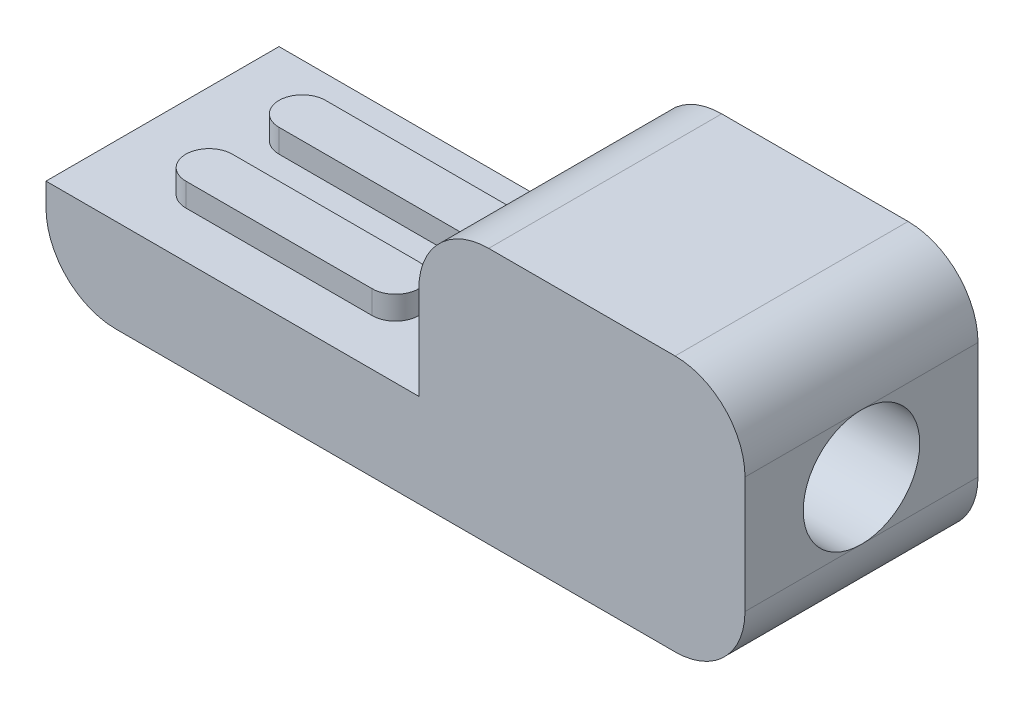
ISO-10303-21;
HEADER;
FILE_DESCRIPTION(('STEP AP214'),'2;1');
FILE_NAME('part.step','',(''),(''),'','','');
FILE_SCHEMA(('AUTOMOTIVE_DESIGN { 1 0 10303 214 1 1 1 1 }'));
ENDSEC;
DATA;
#1=APPLICATION_CONTEXT('core data for automotive mechanical design processes');
#2=APPLICATION_PROTOCOL_DEFINITION('international standard','automotive_design',2000,#1);
#3=PRODUCT_CONTEXT('',#1,'mechanical');
#4=PRODUCT('Part','Part','',(#3));
#5=PRODUCT_RELATED_PRODUCT_CATEGORY('part','',(#4));
#6=PRODUCT_DEFINITION_FORMATION('','',#4);
#7=PRODUCT_DEFINITION_CONTEXT('part definition',#1,'design');
#8=PRODUCT_DEFINITION('design','',#6,#7);
#9=PRODUCT_DEFINITION_SHAPE('','',#8);
#10=(LENGTH_UNIT() NAMED_UNIT(*) SI_UNIT(.MILLI.,.METRE.));
#11=(NAMED_UNIT(*) PLANE_ANGLE_UNIT() SI_UNIT($,.RADIAN.));
#12=(NAMED_UNIT(*) SI_UNIT($,.STERADIAN.) SOLID_ANGLE_UNIT());
#13=UNCERTAINTY_MEASURE_WITH_UNIT(LENGTH_MEASURE(1.E-05),#10,'distance_accuracy_value','');
#14=(GEOMETRIC_REPRESENTATION_CONTEXT(3) GLOBAL_UNCERTAINTY_ASSIGNED_CONTEXT((#13)) GLOBAL_UNIT_ASSIGNED_CONTEXT((#10,
#11,#12)) REPRESENTATION_CONTEXT('',''));
#15=CARTESIAN_POINT('',(0.,0.,0.));
#16=DIRECTION('',(0.,0.,1.));
#17=DIRECTION('',(1.,0.,0.));
#18=AXIS2_PLACEMENT_3D('',#15,#16,#17);
#19=CARTESIAN_POINT('',(-15.,2.,2.5));
#20=DIRECTION('',(0.,-1.,0.));
#21=DIRECTION('',(1.,0.,0.));
#22=AXIS2_PLACEMENT_3D('',#19,#20,#21);
#23=PLANE('',#22);
#24=CARTESIAN_POINT('',(-13.,2.,-1.));
#25=DIRECTION('',(0.,1.,0.));
#26=DIRECTION('',(0.,0.,1.));
#27=AXIS2_PLACEMENT_3D('',#24,#25,#26);
#28=CIRCLE('',#27,0.5);
#29=CARTESIAN_POINT('',(-13.,2.,-1.5));
#30=VERTEX_POINT('',#29);
#31=CARTESIAN_POINT('',(-13.,2.,-0.5));
#32=VERTEX_POINT('',#31);
#33=EDGE_CURVE('E192',#30,#32,#28,.T.);
#34=ORIENTED_EDGE('',*,*,#33,.F.);
#35=DIRECTION('',(-1.,0.,0.));
#36=VECTOR('',#35,1.);
#37=CARTESIAN_POINT('',(-13.,2.,-1.5));
#38=LINE('',#37,#36);
#39=CARTESIAN_POINT('',(-9.,2.,-1.5));
#40=VERTEX_POINT('',#39);
#41=EDGE_CURVE('E205',#40,#30,#38,.T.);
#42=ORIENTED_EDGE('',*,*,#41,.F.);
#43=CARTESIAN_POINT('',(-9.,2.,-1.));
#44=DIRECTION('',(0.,1.,0.));
#45=DIRECTION('',(0.,0.,1.));
#46=AXIS2_PLACEMENT_3D('',#43,#44,#45);
#47=CIRCLE('',#46,0.5);
#48=CARTESIAN_POINT('',(-9.,2.,-0.5));
#49=VERTEX_POINT('',#48);
#50=EDGE_CURVE('E214',#49,#40,#47,.T.);
#51=ORIENTED_EDGE('',*,*,#50,.F.);
#52=DIRECTION('',(1.,0.,0.));
#53=VECTOR('',#52,1.);
#54=CARTESIAN_POINT('',(-13.,2.,-0.5));
#55=LINE('',#54,#53);
#56=EDGE_CURVE('E195',#32,#49,#55,.T.);
#57=ORIENTED_EDGE('',*,*,#56,.F.);
#58=EDGE_LOOP('',(#34,#42,#51,#57));
#59=FACE_BOUND('',#58,.T.);
#60=DIRECTION('',(-1.,0.,0.));
#61=VECTOR('',#60,1.);
#62=CARTESIAN_POINT('',(-15.,2.,-2.5));
#63=LINE('',#62,#61);
#64=CARTESIAN_POINT('',(-7.,2.,-2.5));
#65=VERTEX_POINT('',#64);
#66=CARTESIAN_POINT('',(-15.,2.,-2.5));
#67=VERTEX_POINT('',#66);
#68=EDGE_CURVE('E262',#65,#67,#63,.T.);
#69=ORIENTED_EDGE('',*,*,#68,.T.);
#70=DIRECTION('',(0.,0.,-1.));
#71=VECTOR('',#70,1.);
#72=CARTESIAN_POINT('',(-15.,2.,2.5));
#73=LINE('',#72,#71);
#74=CARTESIAN_POINT('',(-15.,2.,2.5));
#75=VERTEX_POINT('',#74);
#76=EDGE_CURVE('E254',#75,#67,#73,.T.);
#77=ORIENTED_EDGE('',*,*,#76,.F.);
#78=DIRECTION('',(-1.,0.,0.));
#79=VECTOR('',#78,1.);
#80=CARTESIAN_POINT('',(-15.,2.,2.5));
#81=LINE('',#80,#79);
#82=CARTESIAN_POINT('',(-7.,2.,2.5));
#83=VERTEX_POINT('',#82);
#84=EDGE_CURVE('E246',#83,#75,#81,.T.);
#85=ORIENTED_EDGE('',*,*,#84,.F.);
#86=DIRECTION('',(0.,0.,-1.));
#87=VECTOR('',#86,1.);
#88=CARTESIAN_POINT('',(-7.,2.,2.5));
#89=LINE('',#88,#87);
#90=EDGE_CURVE('E271',#83,#65,#89,.T.);
#91=ORIENTED_EDGE('',*,*,#90,.T.);
#92=EDGE_LOOP('',(#69,#77,#85,#91));
#93=FACE_BOUND('',#92,.T.);
#94=CARTESIAN_POINT('',(-13.,2.,1.));
#95=DIRECTION('',(0.,1.,0.));
#96=DIRECTION('',(0.,0.,-1.));
#97=AXIS2_PLACEMENT_3D('',#94,#95,#96);
#98=CIRCLE('',#97,0.5);
#99=CARTESIAN_POINT('',(-13.,2.,0.5));
#100=VERTEX_POINT('',#99);
#101=CARTESIAN_POINT('',(-13.,2.,1.5));
#102=VERTEX_POINT('',#101);
#103=EDGE_CURVE('E191',#100,#102,#98,.T.);
#104=ORIENTED_EDGE('',*,*,#103,.F.);
#105=DIRECTION('',(-1.,0.,0.));
#106=VECTOR('',#105,1.);
#107=CARTESIAN_POINT('',(-13.,2.,0.5));
#108=LINE('',#107,#106);
#109=CARTESIAN_POINT('',(-9.,2.,0.5));
#110=VERTEX_POINT('',#109);
#111=EDGE_CURVE('E188',#110,#100,#108,.T.);
#112=ORIENTED_EDGE('',*,*,#111,.F.);
#113=CARTESIAN_POINT('',(-9.,2.,1.));
#114=DIRECTION('',(0.,1.,0.));
#115=DIRECTION('',(0.,0.,-1.));
#116=AXIS2_PLACEMENT_3D('',#113,#114,#115);
#117=CIRCLE('',#116,0.5);
#118=CARTESIAN_POINT('',(-9.,2.,1.5));
#119=VERTEX_POINT('',#118);
#120=EDGE_CURVE('E57',#119,#110,#117,.T.);
#121=ORIENTED_EDGE('',*,*,#120,.F.);
#122=DIRECTION('',(1.,0.,0.));
#123=VECTOR('',#122,1.);
#124=CARTESIAN_POINT('',(-13.,2.,1.5));
#125=LINE('',#124,#123);
#126=EDGE_CURVE('E52',#102,#119,#125,.T.);
#127=ORIENTED_EDGE('',*,*,#126,.F.);
#128=EDGE_LOOP('',(#104,#112,#121,#127));
#129=FACE_BOUND('',#128,.T.);
#130=ADVANCED_FACE('F37',(#59,#93,#129),#23,.F.);
#131=CARTESIAN_POINT('',(0.,5.5,2.5));
#132=DIRECTION('',(-1.,0.,0.));
#133=DIRECTION('',(0.,-1.,0.));
#134=AXIS2_PLACEMENT_3D('',#131,#132,#133);
#135=PLANE('',#134);
#136=DIRECTION('',(0.,0.,-1.));
#137=VECTOR('',#136,1.);
#138=CARTESIAN_POINT('',(0.,1.5,2.5));
#139=LINE('',#138,#137);
#140=CARTESIAN_POINT('',(0.,1.5,2.5));
#141=VERTEX_POINT('',#140);
#142=CARTESIAN_POINT('',(0.,1.5,0.));
#143=VERTEX_POINT('',#142);
#144=EDGE_CURVE('E11',#141,#143,#139,.T.);
#145=ORIENTED_EDGE('',*,*,#144,.T.);
#146=CARTESIAN_POINT('',(0.,2.75,0.));
#147=DIRECTION('',(1.,0.,0.));
#148=DIRECTION('',(0.,0.,-1.));
#149=AXIS2_PLACEMENT_3D('',#146,#147,#148);
#150=CIRCLE('',#149,1.25);
#151=CARTESIAN_POINT('',(0.,4.,0.));
#152=VERTEX_POINT('',#151);
#153=EDGE_CURVE('E231',#152,#143,#150,.T.);
#154=ORIENTED_EDGE('',*,*,#153,.F.);
#155=DIRECTION('',(0.,0.,-1.));
#156=VECTOR('',#155,1.);
#157=CARTESIAN_POINT('',(0.,4.,2.5));
#158=LINE('',#157,#156);
#159=CARTESIAN_POINT('',(0.,4.,2.5));
#160=VERTEX_POINT('',#159);
#161=EDGE_CURVE('E304',#152,#160,#158,.F.);
#162=ORIENTED_EDGE('',*,*,#161,.T.);
#163=DIRECTION('',(0.,1.,0.));
#164=VECTOR('',#163,1.);
#165=CARTESIAN_POINT('',(0.,5.5,2.5));
#166=LINE('',#165,#164);
#167=EDGE_CURVE('E237',#141,#160,#166,.T.);
#168=ORIENTED_EDGE('',*,*,#167,.F.);
#169=EDGE_LOOP('',(#145,#154,#162,#168));
#170=FACE_BOUND('',#169,.T.);
#171=ADVANCED_FACE('F314',(#170),#135,.F.);
#172=CARTESIAN_POINT('',(0.,4.,-2.5));
#173=VERTEX_POINT('',#172);
#174=EDGE_CURVE('E305',#173,#152,#158,.F.);
#175=ORIENTED_EDGE('',*,*,#174,.T.);
#176=EDGE_CURVE('E230',#143,#152,#150,.T.);
#177=ORIENTED_EDGE('',*,*,#176,.F.);
#178=CARTESIAN_POINT('',(0.,1.5,-2.5));
#179=VERTEX_POINT('',#178);
#180=EDGE_CURVE('E45',#143,#179,#139,.T.);
#181=ORIENTED_EDGE('',*,*,#180,.T.);
#182=DIRECTION('',(0.,1.,0.));
#183=VECTOR('',#182,1.);
#184=CARTESIAN_POINT('',(0.,5.5,-2.5));
#185=LINE('',#184,#183);
#186=EDGE_CURVE('E236',#179,#173,#185,.T.);
#187=ORIENTED_EDGE('',*,*,#186,.T.);
#188=EDGE_LOOP('',(#175,#177,#181,#187));
#189=FACE_BOUND('',#188,.T.);
#190=ADVANCED_FACE('F361',(#189),#135,.F.);
#191=CARTESIAN_POINT('',(-7.,5.5,2.5));
#192=DIRECTION('',(0.,-1.,0.));
#193=DIRECTION('',(0.,0.,-1.));
#194=AXIS2_PLACEMENT_3D('',#191,#192,#193);
#195=PLANE('',#194);
#196=DIRECTION('',(-1.,0.,0.));
#197=VECTOR('',#196,1.);
#198=CARTESIAN_POINT('',(-7.,5.5,-2.5));
#199=LINE('',#198,#197);
#200=CARTESIAN_POINT('',(-1.5,5.5,-2.5));
#201=VERTEX_POINT('',#200);
#202=CARTESIAN_POINT('',(-5.5,5.5,-2.5));
#203=VERTEX_POINT('',#202);
#204=EDGE_CURVE('E257',#201,#203,#199,.T.);
#205=ORIENTED_EDGE('',*,*,#204,.T.);
#206=DIRECTION('',(0.,0.,-1.));
#207=VECTOR('',#206,1.);
#208=CARTESIAN_POINT('',(-5.5,5.5,2.5));
#209=LINE('',#208,#207);
#210=CARTESIAN_POINT('',(-5.5,5.5,2.5));
#211=VERTEX_POINT('',#210);
#212=EDGE_CURVE('E303',#203,#211,#209,.F.);
#213=ORIENTED_EDGE('',*,*,#212,.T.);
#214=DIRECTION('',(-1.,0.,0.));
#215=VECTOR('',#214,1.);
#216=CARTESIAN_POINT('',(-7.,5.5,2.5));
#217=LINE('',#216,#215);
#218=CARTESIAN_POINT('',(-1.5,5.5,2.5));
#219=VERTEX_POINT('',#218);
#220=EDGE_CURVE('E240',#219,#211,#217,.T.);
#221=ORIENTED_EDGE('',*,*,#220,.F.);
#222=DIRECTION('',(0.,0.,-1.));
#223=VECTOR('',#222,1.);
#224=CARTESIAN_POINT('',(-1.5,5.5,2.5));
#225=LINE('',#224,#223);
#226=EDGE_CURVE('E300',#219,#201,#225,.T.);
#227=ORIENTED_EDGE('',*,*,#226,.T.);
#228=EDGE_LOOP('',(#205,#213,#221,#227));
#229=FACE_BOUND('',#228,.T.);
#230=ADVANCED_FACE('F325',(#229),#195,.F.);
#231=CARTESIAN_POINT('',(-7.,2.,2.5));
#232=DIRECTION('',(1.,0.,0.));
#233=DIRECTION('',(0.,0.,-1.));
#234=AXIS2_PLACEMENT_3D('',#231,#232,#233);
#235=PLANE('',#234);
#236=DIRECTION('',(0.,-1.,0.));
#237=VECTOR('',#236,1.);
#238=CARTESIAN_POINT('',(-7.,2.,2.5));
#239=LINE('',#238,#237);
#240=CARTESIAN_POINT('',(-7.,4.,2.5));
#241=VERTEX_POINT('',#240);
#242=EDGE_CURVE('E244',#241,#83,#239,.T.);
#243=ORIENTED_EDGE('',*,*,#242,.F.);
#244=DIRECTION('',(0.,0.,-1.));
#245=VECTOR('',#244,1.);
#246=CARTESIAN_POINT('',(-7.,4.,2.5));
#247=LINE('',#246,#245);
#248=CARTESIAN_POINT('',(-7.,4.,-2.5));
#249=VERTEX_POINT('',#248);
#250=EDGE_CURVE('E297',#241,#249,#247,.T.);
#251=ORIENTED_EDGE('',*,*,#250,.T.);
#252=DIRECTION('',(0.,-1.,0.));
#253=VECTOR('',#252,1.);
#254=CARTESIAN_POINT('',(-7.,2.,-2.5));
#255=LINE('',#254,#253);
#256=EDGE_CURVE('E260',#249,#65,#255,.T.);
#257=ORIENTED_EDGE('',*,*,#256,.T.);
#258=ORIENTED_EDGE('',*,*,#90,.F.);
#259=EDGE_LOOP('',(#243,#251,#257,#258));
#260=FACE_BOUND('',#259,.T.);
#261=ADVANCED_FACE('F339',(#260),#235,.F.);
#262=CARTESIAN_POINT('',(-15.,0.,2.5));
#263=DIRECTION('',(1.,0.,0.));
#264=DIRECTION('',(0.,0.,-1.));
#265=AXIS2_PLACEMENT_3D('',#262,#263,#264);
#266=PLANE('',#265);
#267=DIRECTION('',(0.,-1.,0.));
#268=VECTOR('',#267,1.);
#269=CARTESIAN_POINT('',(-15.,0.,-2.5));
#270=LINE('',#269,#268);
#271=CARTESIAN_POINT('',(-15.,1.5,-2.5));
#272=VERTEX_POINT('',#271);
#273=EDGE_CURVE('E264',#67,#272,#270,.T.);
#274=ORIENTED_EDGE('',*,*,#273,.T.);
#275=DIRECTION('',(0.,0.,-1.));
#276=VECTOR('',#275,1.);
#277=CARTESIAN_POINT('',(-15.,1.5,2.5));
#278=LINE('',#277,#276);
#279=CARTESIAN_POINT('',(-15.,1.5,2.5));
#280=VERTEX_POINT('',#279);
#281=EDGE_CURVE('E287',#272,#280,#278,.F.);
#282=ORIENTED_EDGE('',*,*,#281,.T.);
#283=DIRECTION('',(0.,-1.,0.));
#284=VECTOR('',#283,1.);
#285=CARTESIAN_POINT('',(-15.,0.,2.5));
#286=LINE('',#285,#284);
#287=EDGE_CURVE('E248',#75,#280,#286,.T.);
#288=ORIENTED_EDGE('',*,*,#287,.F.);
#289=ORIENTED_EDGE('',*,*,#76,.T.);
#290=EDGE_LOOP('',(#274,#282,#288,#289));
#291=FACE_BOUND('',#290,.T.);
#292=ADVANCED_FACE('F348',(#291),#266,.F.);
#293=CARTESIAN_POINT('',(0.,0.,2.5));
#294=DIRECTION('',(0.,1.,0.));
#295=DIRECTION('',(-1.,0.,0.));
#296=AXIS2_PLACEMENT_3D('',#293,#294,#295);
#297=PLANE('',#296);
#298=DIRECTION('',(1.,0.,0.));
#299=VECTOR('',#298,1.);
#300=CARTESIAN_POINT('',(0.,0.,2.5));
#301=LINE('',#300,#299);
#302=CARTESIAN_POINT('',(-13.5,0.,2.5));
#303=VERTEX_POINT('',#302);
#304=CARTESIAN_POINT('',(-1.5,0.,2.5));
#305=VERTEX_POINT('',#304);
#306=EDGE_CURVE('E251',#303,#305,#301,.T.);
#307=ORIENTED_EDGE('',*,*,#306,.F.);
#308=DIRECTION('',(0.,0.,-1.));
#309=VECTOR('',#308,1.);
#310=CARTESIAN_POINT('',(-13.5,0.,2.5));
#311=LINE('',#310,#309);
#312=CARTESIAN_POINT('',(-13.5,0.,-2.5));
#313=VERTEX_POINT('',#312);
#314=EDGE_CURVE('E276',#303,#313,#311,.T.);
#315=ORIENTED_EDGE('',*,*,#314,.T.);
#316=DIRECTION('',(1.,0.,0.));
#317=VECTOR('',#316,1.);
#318=CARTESIAN_POINT('',(0.,0.,-2.5));
#319=LINE('',#318,#317);
#320=CARTESIAN_POINT('',(-1.5,0.,-2.5));
#321=VERTEX_POINT('',#320);
#322=EDGE_CURVE('E241',#313,#321,#319,.T.);
#323=ORIENTED_EDGE('',*,*,#322,.T.);
#324=DIRECTION('',(0.,0.,-1.));
#325=VECTOR('',#324,1.);
#326=CARTESIAN_POINT('',(-1.5,0.,2.5));
#327=LINE('',#326,#325);
#328=EDGE_CURVE('E274',#321,#305,#327,.F.);
#329=ORIENTED_EDGE('',*,*,#328,.T.);
#330=EDGE_LOOP('',(#307,#315,#323,#329));
#331=FACE_BOUND('',#330,.T.);
#332=ADVANCED_FACE('F355',(#331),#297,.F.);
#333=CARTESIAN_POINT('',(0.,0.,2.5));
#334=DIRECTION('',(0.,0.,-1.));
#335=DIRECTION('',(-1.,0.,0.));
#336=AXIS2_PLACEMENT_3D('',#333,#334,#335);
#337=PLANE('',#336);
#338=ORIENTED_EDGE('',*,*,#287,.T.);
#339=CARTESIAN_POINT('',(-13.5,1.5,2.5));
#340=DIRECTION('',(0.,0.,-1.));
#341=DIRECTION('',(-1.,0.,0.));
#342=AXIS2_PLACEMENT_3D('',#339,#340,#341);
#343=CIRCLE('',#342,1.5);
#344=EDGE_CURVE('E295',#280,#303,#343,.F.);
#345=ORIENTED_EDGE('',*,*,#344,.T.);
#346=ORIENTED_EDGE('',*,*,#306,.T.);
#347=CARTESIAN_POINT('',(-1.5,1.5,2.5));
#348=DIRECTION('',(0.,0.,-1.));
#349=DIRECTION('',(-1.,0.,0.));
#350=AXIS2_PLACEMENT_3D('',#347,#348,#349);
#351=CIRCLE('',#350,1.5);
#352=EDGE_CURVE('E291',#305,#141,#351,.F.);
#353=ORIENTED_EDGE('',*,*,#352,.T.);
#354=ORIENTED_EDGE('',*,*,#167,.T.);
#355=CARTESIAN_POINT('',(-1.5,4.,2.5));
#356=DIRECTION('',(0.,0.,-1.));
#357=DIRECTION('',(-1.,0.,0.));
#358=AXIS2_PLACEMENT_3D('',#355,#356,#357);
#359=CIRCLE('',#358,1.5);
#360=EDGE_CURVE('E289',#160,#219,#359,.F.);
#361=ORIENTED_EDGE('',*,*,#360,.T.);
#362=ORIENTED_EDGE('',*,*,#220,.T.);
#363=CARTESIAN_POINT('',(-5.5,4.,2.5));
#364=DIRECTION('',(0.,0.,-1.));
#365=DIRECTION('',(-1.,0.,0.));
#366=AXIS2_PLACEMENT_3D('',#363,#364,#365);
#367=CIRCLE('',#366,1.5);
#368=EDGE_CURVE('E293',#211,#241,#367,.F.);
#369=ORIENTED_EDGE('',*,*,#368,.T.);
#370=ORIENTED_EDGE('',*,*,#242,.T.);
#371=ORIENTED_EDGE('',*,*,#84,.T.);
#372=EDGE_LOOP('',(#338,#345,#346,#353,#354,#361,#362,#369,#370,#371));
#373=FACE_BOUND('',#372,.T.);
#374=ADVANCED_FACE('F319',(#373),#337,.F.);
#375=CARTESIAN_POINT('',(0.,0.,-2.5));
#376=DIRECTION('',(0.,0.,-1.));
#377=DIRECTION('',(-1.,0.,0.));
#378=AXIS2_PLACEMENT_3D('',#375,#376,#377);
#379=PLANE('',#378);
#380=ORIENTED_EDGE('',*,*,#322,.F.);
#381=CARTESIAN_POINT('',(-13.5,1.5,-2.5));
#382=DIRECTION('',(0.,0.,-1.));
#383=DIRECTION('',(-1.,0.,0.));
#384=AXIS2_PLACEMENT_3D('',#381,#382,#383);
#385=CIRCLE('',#384,1.5);
#386=EDGE_CURVE('E285',#313,#272,#385,.T.);
#387=ORIENTED_EDGE('',*,*,#386,.T.);
#388=ORIENTED_EDGE('',*,*,#273,.F.);
#389=ORIENTED_EDGE('',*,*,#68,.F.);
#390=ORIENTED_EDGE('',*,*,#256,.F.);
#391=CARTESIAN_POINT('',(-5.5,4.,-2.5));
#392=DIRECTION('',(0.,0.,-1.));
#393=DIRECTION('',(-1.,0.,0.));
#394=AXIS2_PLACEMENT_3D('',#391,#392,#393);
#395=CIRCLE('',#394,1.5);
#396=EDGE_CURVE('E283',#249,#203,#395,.T.);
#397=ORIENTED_EDGE('',*,*,#396,.T.);
#398=ORIENTED_EDGE('',*,*,#204,.F.);
#399=CARTESIAN_POINT('',(-1.5,4.,-2.5));
#400=DIRECTION('',(0.,0.,-1.));
#401=DIRECTION('',(-1.,0.,0.));
#402=AXIS2_PLACEMENT_3D('',#399,#400,#401);
#403=CIRCLE('',#402,1.5);
#404=EDGE_CURVE('E279',#201,#173,#403,.T.);
#405=ORIENTED_EDGE('',*,*,#404,.T.);
#406=ORIENTED_EDGE('',*,*,#186,.F.);
#407=CARTESIAN_POINT('',(-1.5,1.5,-2.5));
#408=DIRECTION('',(0.,0.,-1.));
#409=DIRECTION('',(-1.,0.,0.));
#410=AXIS2_PLACEMENT_3D('',#407,#408,#409);
#411=CIRCLE('',#410,1.5);
#412=EDGE_CURVE('E281',#179,#321,#411,.T.);
#413=ORIENTED_EDGE('',*,*,#412,.T.);
#414=EDGE_LOOP('',(#380,#387,#388,#389,#390,#397,#398,#405,#406,#413));
#415=FACE_BOUND('',#414,.T.);
#416=ADVANCED_FACE('F329',(#415),#379,.T.);
#417=CARTESIAN_POINT('',(-13.5,1.5,2.5));
#418=DIRECTION('',(0.,0.,-1.));
#419=DIRECTION('',(-1.,0.,0.));
#420=AXIS2_PLACEMENT_3D('',#417,#418,#419);
#421=CYLINDRICAL_SURFACE('',#420,1.5);
#422=ORIENTED_EDGE('',*,*,#344,.F.);
#423=ORIENTED_EDGE('',*,*,#281,.F.);
#424=ORIENTED_EDGE('',*,*,#386,.F.);
#425=ORIENTED_EDGE('',*,*,#314,.F.);
#426=EDGE_LOOP('',(#422,#423,#424,#425));
#427=FACE_BOUND('',#426,.T.);
#428=ADVANCED_FACE('F351',(#427),#421,.T.);
#429=CARTESIAN_POINT('',(-5.5,4.,2.5));
#430=DIRECTION('',(0.,0.,-1.));
#431=DIRECTION('',(-1.,0.,0.));
#432=AXIS2_PLACEMENT_3D('',#429,#430,#431);
#433=CYLINDRICAL_SURFACE('',#432,1.5);
#434=ORIENTED_EDGE('',*,*,#368,.F.);
#435=ORIENTED_EDGE('',*,*,#212,.F.);
#436=ORIENTED_EDGE('',*,*,#396,.F.);
#437=ORIENTED_EDGE('',*,*,#250,.F.);
#438=EDGE_LOOP('',(#434,#435,#436,#437));
#439=FACE_BOUND('',#438,.T.);
#440=ADVANCED_FACE('F336',(#439),#433,.T.);
#441=CARTESIAN_POINT('',(-1.5,1.5,2.5));
#442=DIRECTION('',(0.,0.,-1.));
#443=DIRECTION('',(-1.,0.,0.));
#444=AXIS2_PLACEMENT_3D('',#441,#442,#443);
#445=CYLINDRICAL_SURFACE('',#444,1.5);
#446=ORIENTED_EDGE('',*,*,#352,.F.);
#447=ORIENTED_EDGE('',*,*,#328,.F.);
#448=ORIENTED_EDGE('',*,*,#412,.F.);
#449=ORIENTED_EDGE('',*,*,#180,.F.);
#450=ORIENTED_EDGE('',*,*,#144,.F.);
#451=EDGE_LOOP('',(#446,#447,#448,#449,#450));
#452=FACE_BOUND('',#451,.T.);
#453=ADVANCED_FACE('F359',(#452),#445,.T.);
#454=CARTESIAN_POINT('',(-1.5,4.,2.5));
#455=DIRECTION('',(0.,0.,-1.));
#456=DIRECTION('',(-1.,0.,0.));
#457=AXIS2_PLACEMENT_3D('',#454,#455,#456);
#458=CYLINDRICAL_SURFACE('',#457,1.5);
#459=ORIENTED_EDGE('',*,*,#360,.F.);
#460=ORIENTED_EDGE('',*,*,#161,.F.);
#461=ORIENTED_EDGE('',*,*,#174,.F.);
#462=ORIENTED_EDGE('',*,*,#404,.F.);
#463=ORIENTED_EDGE('',*,*,#226,.F.);
#464=EDGE_LOOP('',(#459,#460,#461,#462,#463));
#465=FACE_BOUND('',#464,.T.);
#466=ADVANCED_FACE('F39',(#465),#458,.T.);
#467=CARTESIAN_POINT('',(-5.,2.75,0.));
#468=DIRECTION('',(1.,0.,0.));
#469=DIRECTION('',(0.,0.,-1.));
#470=AXIS2_PLACEMENT_3D('',#467,#468,#469);
#471=CONICAL_SURFACE('',#470,1.25,1.02974425867665);
#472=CARTESIAN_POINT('',(-5.75107577378445,2.75,0.));
#473=VERTEX_POINT('',#472);
#474=VERTEX_LOOP('',#473);
#475=FACE_BOUND('',#474,.T.);
#476=CARTESIAN_POINT('',(-5.,2.75,0.));
#477=DIRECTION('',(1.,0.,0.));
#478=DIRECTION('',(0.,0.,-1.));
#479=AXIS2_PLACEMENT_3D('',#476,#477,#478);
#480=CIRCLE('',#479,1.25);
#481=CARTESIAN_POINT('',(-5.,2.75,-1.25));
#482=VERTEX_POINT('',#481);
#483=EDGE_CURVE('E233',#482,#482,#480,.T.);
#484=ORIENTED_EDGE('',*,*,#483,.T.);
#485=EDGE_LOOP('',(#484));
#486=FACE_BOUND('',#485,.T.);
#487=ADVANCED_FACE('F366',(#475,#486),#471,.F.);
#488=CARTESIAN_POINT('',(0.,2.75,0.));
#489=DIRECTION('',(1.,0.,0.));
#490=DIRECTION('',(0.,0.,-1.));
#491=AXIS2_PLACEMENT_3D('',#488,#489,#490);
#492=CYLINDRICAL_SURFACE('',#491,1.25);
#493=ORIENTED_EDGE('',*,*,#483,.F.);
#494=EDGE_LOOP('',(#493));
#495=FACE_BOUND('',#494,.T.);
#496=ORIENTED_EDGE('',*,*,#153,.T.);
#497=ORIENTED_EDGE('',*,*,#176,.T.);
#498=EDGE_LOOP('',(#496,#497));
#499=FACE_BOUND('',#498,.T.);
#500=ADVANCED_FACE('F363',(#495,#499),#492,.F.);
#501=CARTESIAN_POINT('',(-13.,2.5,-1.));
#502=DIRECTION('',(0.,-1.,0.));
#503=DIRECTION('',(0.,0.,-1.));
#504=AXIS2_PLACEMENT_3D('',#501,#502,#503);
#505=CYLINDRICAL_SURFACE('',#504,0.5);
#506=ORIENTED_EDGE('',*,*,#33,.T.);
#507=DIRECTION('',(0.,-1.,0.));
#508=VECTOR('',#507,1.);
#509=CARTESIAN_POINT('',(-13.,2.5,-0.5));
#510=LINE('',#509,#508);
#511=CARTESIAN_POINT('',(-13.,2.5,-0.5));
#512=VERTEX_POINT('',#511);
#513=EDGE_CURVE('E227',#512,#32,#510,.T.);
#514=ORIENTED_EDGE('',*,*,#513,.F.);
#515=CARTESIAN_POINT('',(-13.,2.5,-1.));
#516=DIRECTION('',(0.,1.,0.));
#517=DIRECTION('',(0.,0.,1.));
#518=AXIS2_PLACEMENT_3D('',#515,#516,#517);
#519=CIRCLE('',#518,0.5);
#520=CARTESIAN_POINT('',(-13.,2.5,-1.5));
#521=VERTEX_POINT('',#520);
#522=EDGE_CURVE('E201',#521,#512,#519,.T.);
#523=ORIENTED_EDGE('',*,*,#522,.F.);
#524=DIRECTION('',(0.,-1.,0.));
#525=VECTOR('',#524,1.);
#526=CARTESIAN_POINT('',(-13.,2.5,-1.5));
#527=LINE('',#526,#525);
#528=EDGE_CURVE('E210',#521,#30,#527,.T.);
#529=ORIENTED_EDGE('',*,*,#528,.T.);
#530=EDGE_LOOP('',(#506,#514,#523,#529));
#531=FACE_BOUND('',#530,.T.);
#532=ADVANCED_FACE('F365',(#531),#505,.T.);
#533=CARTESIAN_POINT('',(-13.,2.5,-0.5));
#534=DIRECTION('',(0.,0.,-1.));
#535=DIRECTION('',(-1.,0.,0.));
#536=AXIS2_PLACEMENT_3D('',#533,#534,#535);
#537=PLANE('',#536);
#538=ORIENTED_EDGE('',*,*,#56,.T.);
#539=DIRECTION('',(0.,-1.,0.));
#540=VECTOR('',#539,1.);
#541=CARTESIAN_POINT('',(-9.,2.5,-0.5));
#542=LINE('',#541,#540);
#543=CARTESIAN_POINT('',(-9.,2.5,-0.5));
#544=VERTEX_POINT('',#543);
#545=EDGE_CURVE('E224',#544,#49,#542,.T.);
#546=ORIENTED_EDGE('',*,*,#545,.F.);
#547=DIRECTION('',(1.,0.,0.));
#548=VECTOR('',#547,1.);
#549=CARTESIAN_POINT('',(-13.,2.5,-0.5));
#550=LINE('',#549,#548);
#551=EDGE_CURVE('E204',#512,#544,#550,.T.);
#552=ORIENTED_EDGE('',*,*,#551,.F.);
#553=ORIENTED_EDGE('',*,*,#513,.T.);
#554=EDGE_LOOP('',(#538,#546,#552,#553));
#555=FACE_BOUND('',#554,.T.);
#556=ADVANCED_FACE('F373',(#555),#537,.F.);
#557=CARTESIAN_POINT('',(-9.,2.5,-1.));
#558=DIRECTION('',(0.,-1.,0.));
#559=DIRECTION('',(0.,0.,-1.));
#560=AXIS2_PLACEMENT_3D('',#557,#558,#559);
#561=CYLINDRICAL_SURFACE('',#560,0.5);
#562=ORIENTED_EDGE('',*,*,#50,.T.);
#563=DIRECTION('',(0.,-1.,0.));
#564=VECTOR('',#563,1.);
#565=CARTESIAN_POINT('',(-9.,2.5,-1.5));
#566=LINE('',#565,#564);
#567=CARTESIAN_POINT('',(-9.,2.5,-1.5));
#568=VERTEX_POINT('',#567);
#569=EDGE_CURVE('E221',#568,#40,#566,.T.);
#570=ORIENTED_EDGE('',*,*,#569,.F.);
#571=CARTESIAN_POINT('',(-9.,2.5,-1.));
#572=DIRECTION('',(0.,1.,0.));
#573=DIRECTION('',(0.,0.,1.));
#574=AXIS2_PLACEMENT_3D('',#571,#572,#573);
#575=CIRCLE('',#574,0.5);
#576=EDGE_CURVE('E207',#544,#568,#575,.T.);
#577=ORIENTED_EDGE('',*,*,#576,.F.);
#578=ORIENTED_EDGE('',*,*,#545,.T.);
#579=EDGE_LOOP('',(#562,#570,#577,#578));
#580=FACE_BOUND('',#579,.T.);
#581=ADVANCED_FACE('F434',(#580),#561,.T.);
#582=CARTESIAN_POINT('',(-13.,2.5,-1.5));
#583=DIRECTION('',(0.,0.,1.));
#584=DIRECTION('',(1.,0.,0.));
#585=AXIS2_PLACEMENT_3D('',#582,#583,#584);
#586=PLANE('',#585);
#587=ORIENTED_EDGE('',*,*,#41,.T.);
#588=ORIENTED_EDGE('',*,*,#528,.F.);
#589=DIRECTION('',(-1.,0.,0.));
#590=VECTOR('',#589,1.);
#591=CARTESIAN_POINT('',(-13.,2.5,-1.5));
#592=LINE('',#591,#590);
#593=EDGE_CURVE('E209',#568,#521,#592,.T.);
#594=ORIENTED_EDGE('',*,*,#593,.F.);
#595=ORIENTED_EDGE('',*,*,#569,.T.);
#596=EDGE_LOOP('',(#587,#588,#594,#595));
#597=FACE_BOUND('',#596,.T.);
#598=ADVANCED_FACE('F444',(#597),#586,.F.);
#599=CARTESIAN_POINT('',(-13.,2.5,-1.));
#600=DIRECTION('',(0.,1.,0.));
#601=DIRECTION('',(0.,0.,1.));
#602=AXIS2_PLACEMENT_3D('',#599,#600,#601);
#603=PLANE('',#602);
#604=ORIENTED_EDGE('',*,*,#522,.T.);
#605=ORIENTED_EDGE('',*,*,#551,.T.);
#606=ORIENTED_EDGE('',*,*,#576,.T.);
#607=ORIENTED_EDGE('',*,*,#593,.T.);
#608=EDGE_LOOP('',(#604,#605,#606,#607));
#609=FACE_BOUND('',#608,.T.);
#610=ADVANCED_FACE('F454',(#609),#603,.T.);
#611=CARTESIAN_POINT('',(-13.,2.5,1.));
#612=DIRECTION('',(0.,-1.,0.));
#613=DIRECTION('',(0.,0.,-1.));
#614=AXIS2_PLACEMENT_3D('',#611,#612,#613);
#615=CYLINDRICAL_SURFACE('',#614,0.5);
#616=ORIENTED_EDGE('',*,*,#103,.T.);
#617=DIRECTION('',(0.,-1.,0.));
#618=VECTOR('',#617,1.);
#619=CARTESIAN_POINT('',(-13.,2.5,1.5));
#620=LINE('',#619,#618);
#621=CARTESIAN_POINT('',(-13.,2.5,1.5));
#622=VERTEX_POINT('',#621);
#623=EDGE_CURVE('E172',#622,#102,#620,.T.);
#624=ORIENTED_EDGE('',*,*,#623,.F.);
#625=CARTESIAN_POINT('',(-13.,2.5,1.));
#626=DIRECTION('',(0.,1.,0.));
#627=DIRECTION('',(0.,0.,-1.));
#628=AXIS2_PLACEMENT_3D('',#625,#626,#627);
#629=CIRCLE('',#628,0.5);
#630=CARTESIAN_POINT('',(-13.,2.5,0.5));
#631=VERTEX_POINT('',#630);
#632=EDGE_CURVE('E179',#631,#622,#629,.T.);
#633=ORIENTED_EDGE('',*,*,#632,.F.);
#634=DIRECTION('',(0.,-1.,0.));
#635=VECTOR('',#634,1.);
#636=CARTESIAN_POINT('',(-13.,2.5,0.5));
#637=LINE('',#636,#635);
#638=EDGE_CURVE('E514',#631,#100,#637,.T.);
#639=ORIENTED_EDGE('',*,*,#638,.T.);
#640=EDGE_LOOP('',(#616,#624,#633,#639));
#641=FACE_BOUND('',#640,.T.);
#642=ADVANCED_FACE('F190',(#641),#615,.T.);
#643=CARTESIAN_POINT('',(-13.,2.5,1.5));
#644=DIRECTION('',(0.,0.,-1.));
#645=DIRECTION('',(-1.,0.,0.));
#646=AXIS2_PLACEMENT_3D('',#643,#644,#645);
#647=PLANE('',#646);
#648=ORIENTED_EDGE('',*,*,#126,.T.);
#649=DIRECTION('',(0.,-1.,0.));
#650=VECTOR('',#649,1.);
#651=CARTESIAN_POINT('',(-9.,2.5,1.5));
#652=LINE('',#651,#650);
#653=CARTESIAN_POINT('',(-9.,2.5,1.5));
#654=VERTEX_POINT('',#653);
#655=EDGE_CURVE('E175',#654,#119,#652,.T.);
#656=ORIENTED_EDGE('',*,*,#655,.F.);
#657=DIRECTION('',(1.,0.,0.));
#658=VECTOR('',#657,1.);
#659=CARTESIAN_POINT('',(-13.,2.5,1.5));
#660=LINE('',#659,#658);
#661=EDGE_CURVE('E168',#622,#654,#660,.T.);
#662=ORIENTED_EDGE('',*,*,#661,.F.);
#663=ORIENTED_EDGE('',*,*,#623,.T.);
#664=EDGE_LOOP('',(#648,#656,#662,#663));
#665=FACE_BOUND('',#664,.T.);
#666=ADVANCED_FACE('F170',(#665),#647,.F.);
#667=CARTESIAN_POINT('',(-9.,2.5,1.));
#668=DIRECTION('',(0.,-1.,0.));
#669=DIRECTION('',(0.,0.,-1.));
#670=AXIS2_PLACEMENT_3D('',#667,#668,#669);
#671=CYLINDRICAL_SURFACE('',#670,0.5);
#672=ORIENTED_EDGE('',*,*,#120,.T.);
#673=DIRECTION('',(0.,-1.,0.));
#674=VECTOR('',#673,1.);
#675=CARTESIAN_POINT('',(-9.,2.5,0.5));
#676=LINE('',#675,#674);
#677=CARTESIAN_POINT('',(-9.,2.5,0.5));
#678=VERTEX_POINT('',#677);
#679=EDGE_CURVE('E197',#678,#110,#676,.T.);
#680=ORIENTED_EDGE('',*,*,#679,.F.);
#681=CARTESIAN_POINT('',(-9.,2.5,1.));
#682=DIRECTION('',(0.,1.,0.));
#683=DIRECTION('',(0.,0.,-1.));
#684=AXIS2_PLACEMENT_3D('',#681,#682,#683);
#685=CIRCLE('',#684,0.5);
#686=EDGE_CURVE('E178',#654,#678,#685,.T.);
#687=ORIENTED_EDGE('',*,*,#686,.F.);
#688=ORIENTED_EDGE('',*,*,#655,.T.);
#689=EDGE_LOOP('',(#672,#680,#687,#688));
#690=FACE_BOUND('',#689,.T.);
#691=ADVANCED_FACE('F481',(#690),#671,.T.);
#692=CARTESIAN_POINT('',(-13.,2.5,0.5));
#693=DIRECTION('',(0.,0.,1.));
#694=DIRECTION('',(1.,0.,0.));
#695=AXIS2_PLACEMENT_3D('',#692,#693,#694);
#696=PLANE('',#695);
#697=ORIENTED_EDGE('',*,*,#111,.T.);
#698=ORIENTED_EDGE('',*,*,#638,.F.);
#699=DIRECTION('',(-1.,0.,0.));
#700=VECTOR('',#699,1.);
#701=CARTESIAN_POINT('',(-13.,2.5,0.5));
#702=LINE('',#701,#700);
#703=EDGE_CURVE('E184',#678,#631,#702,.T.);
#704=ORIENTED_EDGE('',*,*,#703,.F.);
#705=ORIENTED_EDGE('',*,*,#679,.T.);
#706=EDGE_LOOP('',(#697,#698,#704,#705));
#707=FACE_BOUND('',#706,.T.);
#708=ADVANCED_FACE('F490',(#707),#696,.F.);
#709=CARTESIAN_POINT('',(-13.,2.5,1.));
#710=DIRECTION('',(0.,-1.,0.));
#711=DIRECTION('',(0.,0.,-1.));
#712=AXIS2_PLACEMENT_3D('',#709,#710,#711);
#713=PLANE('',#712);
#714=ORIENTED_EDGE('',*,*,#632,.T.);
#715=ORIENTED_EDGE('',*,*,#661,.T.);
#716=ORIENTED_EDGE('',*,*,#686,.T.);
#717=ORIENTED_EDGE('',*,*,#703,.T.);
#718=EDGE_LOOP('',(#714,#715,#716,#717));
#719=FACE_BOUND('',#718,.T.);
#720=ADVANCED_FACE('F182',(#719),#713,.F.);
#721=CLOSED_SHELL('',(#130,#171,#190,#230,#261,#292,#332,#374,#416,#428,#440,#453,#466,#487,
#500,#532,#556,#581,#598,#610,#642,#666,#691,#708,#720));
#722=MANIFOLD_SOLID_BREP('B2',#721);
#723=ADVANCED_BREP_SHAPE_REPRESENTATION('',(#18,#722),#14);
#724=SHAPE_DEFINITION_REPRESENTATION(#9,#723);
ENDSEC;
END-ISO-10303-21;
